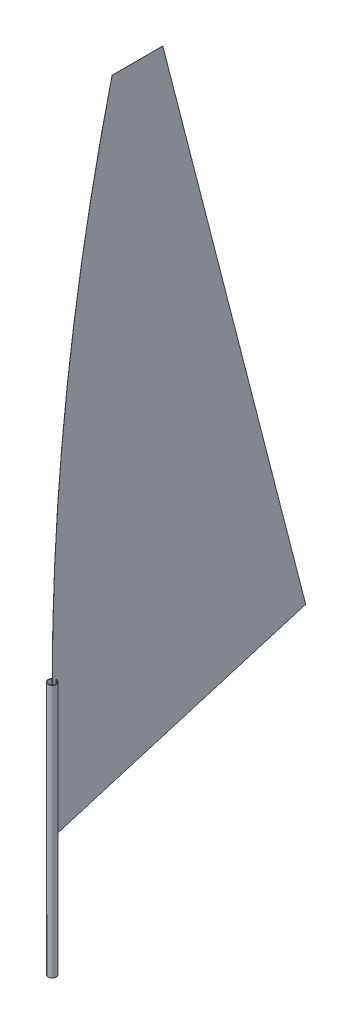
ISO-10303-21;
HEADER;
FILE_DESCRIPTION(('STEP AP214'),'2;1');
FILE_NAME('part.step','',(''),(''),'','','');
FILE_SCHEMA(('AUTOMOTIVE_DESIGN { 1 0 10303 214 1 1 1 1 }'));
ENDSEC;
DATA;
#1=APPLICATION_CONTEXT('core data for automotive mechanical design processes');
#2=APPLICATION_PROTOCOL_DEFINITION('international standard','automotive_design',2000,#1);
#3=PRODUCT_CONTEXT('',#1,'mechanical');
#4=PRODUCT('Part','Part','',(#3));
#5=PRODUCT_RELATED_PRODUCT_CATEGORY('part','',(#4));
#6=PRODUCT_DEFINITION_FORMATION('','',#4);
#7=PRODUCT_DEFINITION_CONTEXT('part definition',#1,'design');
#8=PRODUCT_DEFINITION('design','',#6,#7);
#9=PRODUCT_DEFINITION_SHAPE('','',#8);
#10=(LENGTH_UNIT() NAMED_UNIT(*) SI_UNIT(.MILLI.,.METRE.));
#11=(NAMED_UNIT(*) PLANE_ANGLE_UNIT() SI_UNIT($,.RADIAN.));
#12=(NAMED_UNIT(*) SI_UNIT($,.STERADIAN.) SOLID_ANGLE_UNIT());
#13=UNCERTAINTY_MEASURE_WITH_UNIT(LENGTH_MEASURE(1.E-05),#10,'distance_accuracy_value','');
#14=(GEOMETRIC_REPRESENTATION_CONTEXT(3) GLOBAL_UNCERTAINTY_ASSIGNED_CONTEXT((#13)) GLOBAL_UNIT_ASSIGNED_CONTEXT((#10,
#11,#12)) REPRESENTATION_CONTEXT('',''));
#15=CARTESIAN_POINT('',(0.,0.,0.));
#16=DIRECTION('',(0.,0.,1.));
#17=DIRECTION('',(1.,0.,0.));
#18=AXIS2_PLACEMENT_3D('',#15,#16,#17);
#19=CARTESIAN_POINT('',(0.5,400.,0.));
#20=DIRECTION('',(0.,0.,-1.));
#21=DIRECTION('',(-1.,0.,0.));
#22=AXIS2_PLACEMENT_3D('',#19,#20,#21);
#23=PLANE('',#22);
#24=DIRECTION('',(0.,-1.,0.));
#25=VECTOR('',#24,1.);
#26=CARTESIAN_POINT('',(-0.5,400.,0.));
#27=LINE('',#26,#25);
#28=CARTESIAN_POINT('',(-0.5,2000.,0.));
#29=VERTEX_POINT('',#28);
#30=CARTESIAN_POINT('',(-0.5,400.,0.));
#31=VERTEX_POINT('',#30);
#32=EDGE_CURVE('E121',#29,#31,#27,.T.);
#33=ORIENTED_EDGE('',*,*,#32,.T.);
#34=DIRECTION('',(-1.,0.,0.));
#35=VECTOR('',#34,1.);
#36=CARTESIAN_POINT('',(0.5,400.,0.));
#37=LINE('',#36,#35);
#38=CARTESIAN_POINT('',(0.5,400.,0.));
#39=VERTEX_POINT('',#38);
#40=EDGE_CURVE('E12',#39,#31,#37,.T.);
#41=ORIENTED_EDGE('',*,*,#40,.F.);
#42=DIRECTION('',(0.,-1.,0.));
#43=VECTOR('',#42,1.);
#44=CARTESIAN_POINT('',(0.5,400.,0.));
#45=LINE('',#44,#43);
#46=CARTESIAN_POINT('',(0.5,2000.,0.));
#47=VERTEX_POINT('',#46);
#48=EDGE_CURVE('E129',#47,#39,#45,.T.);
#49=ORIENTED_EDGE('',*,*,#48,.F.);
#50=DIRECTION('',(-1.,0.,0.));
#51=VECTOR('',#50,1.);
#52=CARTESIAN_POINT('',(0.5,2000.,0.));
#53=LINE('',#52,#51);
#54=EDGE_CURVE('E117',#47,#29,#53,.T.);
#55=ORIENTED_EDGE('',*,*,#54,.T.);
#56=EDGE_LOOP('',(#33,#41,#49,#55));
#57=FACE_BOUND('',#56,.T.);
#58=ADVANCED_FACE('F47',(#57),#23,.F.);
#59=CARTESIAN_POINT('',(0.5,400.,0.));
#60=DIRECTION('',(0.,0.958177374409472,0.286174979985622));
#61=DIRECTION('',(0.,-0.286174979985622,0.958177374409472));
#62=AXIS2_PLACEMENT_3D('',#59,#60,#61);
#63=PLANE('',#62);
#64=DIRECTION('',(0.,0.286174979985622,-0.958177374409472));
#65=VECTOR('',#64,1.);
#66=CARTESIAN_POINT('',(-0.5,400.,0.));
#67=LINE('',#66,#65);
#68=CARTESIAN_POINT('',(-0.5,1295.99792573476,-3000.));
#69=VERTEX_POINT('',#68);
#70=EDGE_CURVE('E124',#31,#69,#67,.T.);
#71=ORIENTED_EDGE('',*,*,#70,.T.);
#72=DIRECTION('',(-1.,0.,0.));
#73=VECTOR('',#72,1.);
#74=CARTESIAN_POINT('',(0.5,1295.99792573476,-3000.));
#75=LINE('',#74,#73);
#76=CARTESIAN_POINT('',(0.5,1295.99792573476,-3000.));
#77=VERTEX_POINT('',#76);
#78=EDGE_CURVE('E55',#77,#69,#75,.T.);
#79=ORIENTED_EDGE('',*,*,#78,.F.);
#80=DIRECTION('',(0.,0.286174979985622,-0.958177374409472));
#81=VECTOR('',#80,1.);
#82=CARTESIAN_POINT('',(0.5,400.,0.));
#83=LINE('',#82,#81);
#84=EDGE_CURVE('E97',#39,#77,#83,.T.);
#85=ORIENTED_EDGE('',*,*,#84,.F.);
#86=ORIENTED_EDGE('',*,*,#40,.T.);
#87=EDGE_LOOP('',(#71,#79,#85,#86));
#88=FACE_BOUND('',#87,.T.);
#89=ADVANCED_FACE('F148',(#88),#63,.F.);
#90=CARTESIAN_POINT('',(0.5,1295.99792573476,-3000.));
#91=DIRECTION('',(0.,-0.249387770415358,0.968403707121806));
#92=DIRECTION('',(0.,-0.968403707121806,-0.249387770415358));
#93=AXIS2_PLACEMENT_3D('',#90,#91,#92);
#94=PLANE('',#93);
#95=DIRECTION('',(0.,0.968403707121806,0.249387770415358));
#96=VECTOR('',#95,1.);
#97=CARTESIAN_POINT('',(-0.5,1295.99792573476,-3000.));
#98=LINE('',#97,#96);
#99=CARTESIAN_POINT('',(-0.5,7866.51421020936,-1307.93046886094));
#100=VERTEX_POINT('',#99);
#101=EDGE_CURVE('E112',#69,#100,#98,.T.);
#102=ORIENTED_EDGE('',*,*,#101,.T.);
#103=DIRECTION('',(-1.,0.,0.));
#104=VECTOR('',#103,1.);
#105=CARTESIAN_POINT('',(0.5,7866.51421020936,-1307.93046886094));
#106=LINE('',#105,#104);
#107=CARTESIAN_POINT('',(0.5,7866.51421020936,-1307.93046886094));
#108=VERTEX_POINT('',#107);
#109=EDGE_CURVE('E109',#108,#100,#106,.T.);
#110=ORIENTED_EDGE('',*,*,#109,.F.);
#111=DIRECTION('',(0.,0.968403707121806,0.249387770415358));
#112=VECTOR('',#111,1.);
#113=CARTESIAN_POINT('',(0.5,1295.99792573476,-3000.));
#114=LINE('',#113,#112);
#115=EDGE_CURVE('E101',#77,#108,#114,.T.);
#116=ORIENTED_EDGE('',*,*,#115,.F.);
#117=ORIENTED_EDGE('',*,*,#78,.T.);
#118=EDGE_LOOP('',(#102,#110,#116,#117));
#119=FACE_BOUND('',#118,.T.);
#120=ADVANCED_FACE('F110',(#119),#94,.F.);
#121=CARTESIAN_POINT('',(0.5,7866.51421020936,-1307.93046886094));
#122=DIRECTION('',(0.,-1.,0.));
#123=DIRECTION('',(0.,0.,-1.));
#124=AXIS2_PLACEMENT_3D('',#121,#122,#123);
#125=PLANE('',#124);
#126=DIRECTION('',(0.,0.,1.));
#127=VECTOR('',#126,1.);
#128=CARTESIAN_POINT('',(-0.5,7866.51421020936,-1307.93046886094));
#129=LINE('',#128,#127);
#130=CARTESIAN_POINT('',(-0.5,7866.51421020936,-707.930468860935));
#131=VERTEX_POINT('',#130);
#132=EDGE_CURVE('E83',#100,#131,#129,.T.);
#133=ORIENTED_EDGE('',*,*,#132,.T.);
#134=DIRECTION('',(-1.,0.,0.));
#135=VECTOR('',#134,1.);
#136=CARTESIAN_POINT('',(0.5,7866.51421020936,-707.930468860935));
#137=LINE('',#136,#135);
#138=CARTESIAN_POINT('',(0.5,7866.51421020936,-707.930468860935));
#139=VERTEX_POINT('',#138);
#140=EDGE_CURVE('E113',#139,#131,#137,.T.);
#141=ORIENTED_EDGE('',*,*,#140,.F.);
#142=DIRECTION('',(0.,0.,1.));
#143=VECTOR('',#142,1.);
#144=CARTESIAN_POINT('',(0.5,7866.51421020936,-1307.93046886094));
#145=LINE('',#144,#143);
#146=EDGE_CURVE('E105',#108,#139,#145,.T.);
#147=ORIENTED_EDGE('',*,*,#146,.F.);
#148=ORIENTED_EDGE('',*,*,#109,.T.);
#149=EDGE_LOOP('',(#133,#141,#147,#148));
#150=FACE_BOUND('',#149,.T.);
#151=ADVANCED_FACE('F115',(#150),#125,.F.);
#152=CARTESIAN_POINT('',(0.5,2000.,-24661.4293798599));
#153=DIRECTION('',(-1.,0.,0.));
#154=DIRECTION('',(0.,0.,1.));
#155=AXIS2_PLACEMENT_3D('',#152,#153,#154);
#156=CYLINDRICAL_SURFACE('',#155,24661.4293798599);
#157=CARTESIAN_POINT('',(-0.5,2000.,-24661.4293798599));
#158=DIRECTION('',(1.,0.,0.));
#159=DIRECTION('',(0.,0.,1.));
#160=AXIS2_PLACEMENT_3D('',#157,#158,#159);
#161=CIRCLE('',#160,24661.4293798599);
#162=EDGE_CURVE('E89',#131,#29,#161,.T.);
#163=ORIENTED_EDGE('',*,*,#162,.T.);
#164=ORIENTED_EDGE('',*,*,#54,.F.);
#165=CARTESIAN_POINT('',(0.5,2000.,-24661.4293798599));
#166=DIRECTION('',(1.,0.,0.));
#167=DIRECTION('',(0.,0.,1.));
#168=AXIS2_PLACEMENT_3D('',#165,#166,#167);
#169=CIRCLE('',#168,24661.4293798599);
#170=EDGE_CURVE('E63',#139,#47,#169,.T.);
#171=ORIENTED_EDGE('',*,*,#170,.F.);
#172=ORIENTED_EDGE('',*,*,#140,.T.);
#173=EDGE_LOOP('',(#163,#164,#171,#172));
#174=FACE_BOUND('',#173,.T.);
#175=ADVANCED_FACE('F137',(#174),#156,.T.);
#176=CARTESIAN_POINT('',(0.5,2000.,-24661.4293798599));
#177=DIRECTION('',(-1.,0.,0.));
#178=DIRECTION('',(0.,0.,1.));
#179=AXIS2_PLACEMENT_3D('',#176,#177,#178);
#180=PLANE('',#179);
#181=ORIENTED_EDGE('',*,*,#48,.T.);
#182=ORIENTED_EDGE('',*,*,#84,.T.);
#183=ORIENTED_EDGE('',*,*,#115,.T.);
#184=ORIENTED_EDGE('',*,*,#146,.T.);
#185=ORIENTED_EDGE('',*,*,#170,.T.);
#186=EDGE_LOOP('',(#181,#182,#183,#184,#185));
#187=FACE_BOUND('',#186,.T.);
#188=ADVANCED_FACE('F103',(#187),#180,.F.);
#189=CARTESIAN_POINT('',(-0.5,2000.,-24661.4293798599));
#190=DIRECTION('',(-1.,0.,0.));
#191=DIRECTION('',(0.,0.,1.));
#192=AXIS2_PLACEMENT_3D('',#189,#190,#191);
#193=PLANE('',#192);
#194=ORIENTED_EDGE('',*,*,#32,.F.);
#195=ORIENTED_EDGE('',*,*,#162,.F.);
#196=ORIENTED_EDGE('',*,*,#132,.F.);
#197=ORIENTED_EDGE('',*,*,#101,.F.);
#198=ORIENTED_EDGE('',*,*,#70,.F.);
#199=EDGE_LOOP('',(#194,#195,#196,#197,#198));
#200=FACE_BOUND('',#199,.T.);
#201=ADVANCED_FACE('F133',(#200),#193,.T.);
#202=CLOSED_SHELL('',(#58,#89,#120,#151,#175,#188,#201));
#203=MANIFOLD_SOLID_BREP('B2',#202);
#204=CARTESIAN_POINT('',(0.,2000.,0.));
#205=DIRECTION('',(0.,1.,0.));
#206=DIRECTION('',(0.,0.,1.));
#207=AXIS2_PLACEMENT_3D('',#204,#205,#206);
#208=PLANE('',#207);
#209=CARTESIAN_POINT('',(0.,2000.,0.));
#210=DIRECTION('',(0.,1.,0.));
#211=DIRECTION('',(0.,0.,1.));
#212=AXIS2_PLACEMENT_3D('',#209,#210,#211);
#213=CIRCLE('',#212,50.);
#214=CARTESIAN_POINT('',(0.,2000.,50.));
#215=VERTEX_POINT('',#214);
#216=EDGE_CURVE('E46',#215,#215,#213,.T.);
#217=ORIENTED_EDGE('',*,*,#216,.T.);
#218=EDGE_LOOP('',(#217));
#219=FACE_BOUND('',#218,.T.);
#220=CARTESIAN_POINT('',(0.,2000.,0.));
#221=DIRECTION('',(0.,1.,0.));
#222=DIRECTION('',(0.,0.,1.));
#223=AXIS2_PLACEMENT_3D('',#220,#221,#222);
#224=CIRCLE('',#223,44.);
#225=CARTESIAN_POINT('',(0.,2000.,44.));
#226=VERTEX_POINT('',#225);
#227=EDGE_CURVE('E217',#226,#226,#224,.T.);
#228=ORIENTED_EDGE('',*,*,#227,.F.);
#229=EDGE_LOOP('',(#228));
#230=FACE_BOUND('',#229,.T.);
#231=ADVANCED_FACE('F210',(#219,#230),#208,.T.);
#232=CARTESIAN_POINT('',(0.,2000.,0.));
#233=DIRECTION('',(0.,-1.,0.));
#234=DIRECTION('',(0.,0.,-1.));
#235=AXIS2_PLACEMENT_3D('',#232,#233,#234);
#236=CYLINDRICAL_SURFACE('',#235,50.);
#237=ORIENTED_EDGE('',*,*,#216,.F.);
#238=EDGE_LOOP('',(#237));
#239=FACE_BOUND('',#238,.T.);
#240=CARTESIAN_POINT('',(0.,-1000.,0.));
#241=DIRECTION('',(0.,1.,0.));
#242=DIRECTION('',(0.,0.,1.));
#243=AXIS2_PLACEMENT_3D('',#240,#241,#242);
#244=CIRCLE('',#243,50.);
#245=CARTESIAN_POINT('',(0.,-1000.,50.));
#246=VERTEX_POINT('',#245);
#247=EDGE_CURVE('E221',#246,#246,#244,.T.);
#248=ORIENTED_EDGE('',*,*,#247,.T.);
#249=EDGE_LOOP('',(#248));
#250=FACE_BOUND('',#249,.T.);
#251=ADVANCED_FACE('F212',(#239,#250),#236,.T.);
#252=CARTESIAN_POINT('',(0.,2000.,0.));
#253=DIRECTION('',(0.,-1.,0.));
#254=DIRECTION('',(0.,0.,-1.));
#255=AXIS2_PLACEMENT_3D('',#252,#253,#254);
#256=CYLINDRICAL_SURFACE('',#255,44.);
#257=ORIENTED_EDGE('',*,*,#227,.T.);
#258=EDGE_LOOP('',(#257));
#259=FACE_BOUND('',#258,.T.);
#260=CARTESIAN_POINT('',(0.,-1000.,0.));
#261=DIRECTION('',(0.,1.,0.));
#262=DIRECTION('',(0.,0.,1.));
#263=AXIS2_PLACEMENT_3D('',#260,#261,#262);
#264=CIRCLE('',#263,44.);
#265=CARTESIAN_POINT('',(0.,-1000.,44.));
#266=VERTEX_POINT('',#265);
#267=EDGE_CURVE('E225',#266,#266,#264,.T.);
#268=ORIENTED_EDGE('',*,*,#267,.F.);
#269=EDGE_LOOP('',(#268));
#270=FACE_BOUND('',#269,.T.);
#271=ADVANCED_FACE('F234',(#259,#270),#256,.F.);
#272=CARTESIAN_POINT('',(0.,-1000.,0.));
#273=DIRECTION('',(0.,1.,0.));
#274=DIRECTION('',(0.,0.,1.));
#275=AXIS2_PLACEMENT_3D('',#272,#273,#274);
#276=PLANE('',#275);
#277=ORIENTED_EDGE('',*,*,#267,.T.);
#278=EDGE_LOOP('',(#277));
#279=FACE_BOUND('',#278,.T.);
#280=ORIENTED_EDGE('',*,*,#247,.F.);
#281=EDGE_LOOP('',(#280));
#282=FACE_BOUND('',#281,.T.);
#283=ADVANCED_FACE('F231',(#279,#282),#276,.F.);
#284=CLOSED_SHELL('',(#231,#251,#271,#283));
#285=MANIFOLD_SOLID_BREP('B6',#284);
#286=ADVANCED_BREP_SHAPE_REPRESENTATION('',(#18,#203,#285),#14);
#287=SHAPE_DEFINITION_REPRESENTATION(#9,#286);
ENDSEC;
END-ISO-10303-21;
